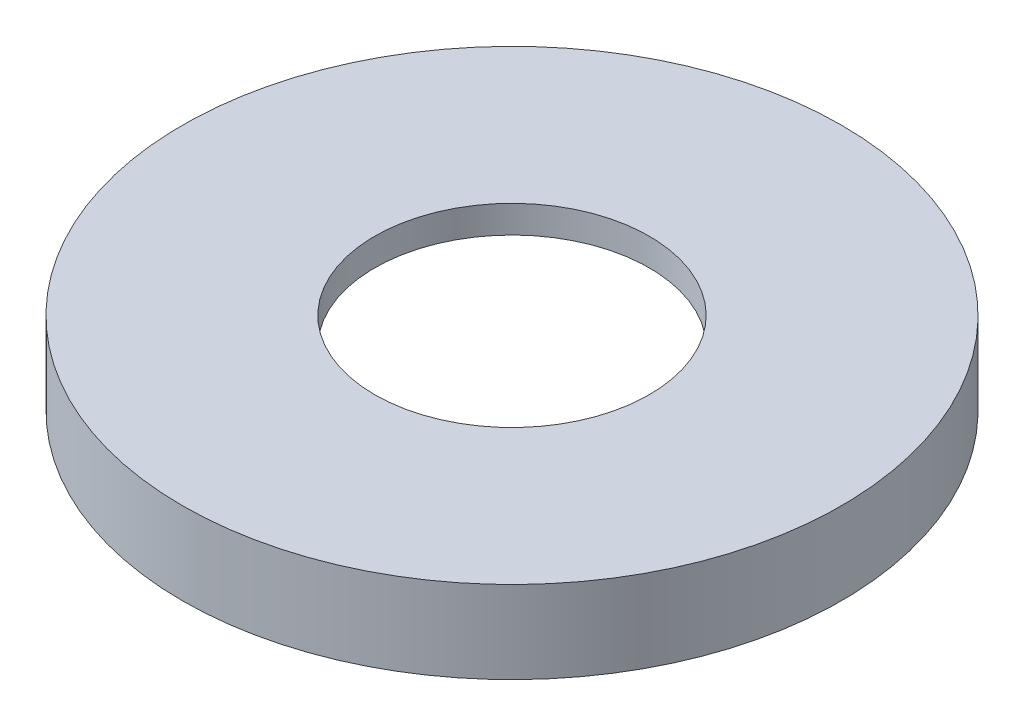
ISO-10303-21;
HEADER;
FILE_DESCRIPTION(('STEP AP214'),'2;1');
FILE_NAME('part.step','',(''),(''),'','','');
FILE_SCHEMA(('AUTOMOTIVE_DESIGN { 1 0 10303 214 1 1 1 1 }'));
ENDSEC;
DATA;
#1=APPLICATION_CONTEXT('core data for automotive mechanical design processes');
#2=APPLICATION_PROTOCOL_DEFINITION('international standard','automotive_design',2000,#1);
#3=PRODUCT_CONTEXT('',#1,'mechanical');
#4=PRODUCT('Part','Part','',(#3));
#5=PRODUCT_RELATED_PRODUCT_CATEGORY('part','',(#4));
#6=PRODUCT_DEFINITION_FORMATION('','',#4);
#7=PRODUCT_DEFINITION_CONTEXT('part definition',#1,'design');
#8=PRODUCT_DEFINITION('design','',#6,#7);
#9=PRODUCT_DEFINITION_SHAPE('','',#8);
#10=(LENGTH_UNIT() NAMED_UNIT(*) SI_UNIT(.MILLI.,.METRE.));
#11=(NAMED_UNIT(*) PLANE_ANGLE_UNIT() SI_UNIT($,.RADIAN.));
#12=(NAMED_UNIT(*) SI_UNIT($,.STERADIAN.) SOLID_ANGLE_UNIT());
#13=UNCERTAINTY_MEASURE_WITH_UNIT(LENGTH_MEASURE(1.E-05),#10,'distance_accuracy_value','');
#14=(GEOMETRIC_REPRESENTATION_CONTEXT(3) GLOBAL_UNCERTAINTY_ASSIGNED_CONTEXT((#13)) GLOBAL_UNIT_ASSIGNED_CONTEXT((#10,
#11,#12)) REPRESENTATION_CONTEXT('',''));
#15=CARTESIAN_POINT('',(0.,0.,0.));
#16=DIRECTION('',(0.,0.,1.));
#17=DIRECTION('',(1.,0.,0.));
#18=AXIS2_PLACEMENT_3D('',#15,#16,#17);
#19=CARTESIAN_POINT('',(0.,-6.35,0.));
#20=DIRECTION('',(0.,1.,0.));
#21=DIRECTION('',(0.,0.,1.));
#22=AXIS2_PLACEMENT_3D('',#19,#20,#21);
#23=CYLINDRICAL_SURFACE('',#22,38.1);
#24=CARTESIAN_POINT('',(0.,-6.35,0.));
#25=DIRECTION('',(0.,1.,0.));
#26=DIRECTION('',(0.,0.,1.));
#27=AXIS2_PLACEMENT_3D('',#24,#25,#26);
#28=CIRCLE('',#27,38.1);
#29=CARTESIAN_POINT('',(0.,-6.35,38.1));
#30=VERTEX_POINT('',#29);
#31=EDGE_CURVE('E10',#30,#30,#28,.T.);
#32=ORIENTED_EDGE('',*,*,#31,.T.);
#33=EDGE_LOOP('',(#32));
#34=FACE_BOUND('',#33,.T.);
#35=CARTESIAN_POINT('',(0.,3.175,0.));
#36=DIRECTION('',(0.,1.,0.));
#37=DIRECTION('',(0.,0.,1.));
#38=AXIS2_PLACEMENT_3D('',#35,#36,#37);
#39=CIRCLE('',#38,38.1);
#40=CARTESIAN_POINT('',(0.,3.175,38.1));
#41=VERTEX_POINT('',#40);
#42=EDGE_CURVE('E59',#41,#41,#39,.T.);
#43=ORIENTED_EDGE('',*,*,#42,.F.);
#44=EDGE_LOOP('',(#43));
#45=FACE_BOUND('',#44,.T.);
#46=ADVANCED_FACE('F41',(#34,#45),#23,.T.);
#47=CARTESIAN_POINT('',(0.,-6.35,0.));
#48=DIRECTION('',(0.,1.,0.));
#49=DIRECTION('',(0.,0.,1.));
#50=AXIS2_PLACEMENT_3D('',#47,#48,#49);
#51=PLANE('',#50);
#52=CARTESIAN_POINT('',(0.,-6.35,0.));
#53=DIRECTION('',(0.,1.,0.));
#54=DIRECTION('',(0.,0.,1.));
#55=AXIS2_PLACEMENT_3D('',#52,#53,#54);
#56=CIRCLE('',#55,33.0835);
#57=CARTESIAN_POINT('',(0.,-6.35,33.0835));
#58=VERTEX_POINT('',#57);
#59=EDGE_CURVE('E48',#58,#58,#56,.T.);
#60=ORIENTED_EDGE('',*,*,#59,.T.);
#61=EDGE_LOOP('',(#60));
#62=FACE_BOUND('',#61,.T.);
#63=ORIENTED_EDGE('',*,*,#31,.F.);
#64=EDGE_LOOP('',(#63));
#65=FACE_BOUND('',#64,.T.);
#66=ADVANCED_FACE('F90',(#62,#65),#51,.F.);
#67=CARTESIAN_POINT('',(0.,-6.35,0.));
#68=DIRECTION('',(0.,1.,0.));
#69=DIRECTION('',(0.,0.,1.));
#70=AXIS2_PLACEMENT_3D('',#67,#68,#69);
#71=CYLINDRICAL_SURFACE('',#70,33.0835);
#72=ORIENTED_EDGE('',*,*,#59,.F.);
#73=EDGE_LOOP('',(#72));
#74=FACE_BOUND('',#73,.T.);
#75=CARTESIAN_POINT('',(0.,0.,0.));
#76=DIRECTION('',(0.,1.,0.));
#77=DIRECTION('',(0.,0.,1.));
#78=AXIS2_PLACEMENT_3D('',#75,#76,#77);
#79=CIRCLE('',#78,33.0835);
#80=CARTESIAN_POINT('',(0.,0.,33.0835));
#81=VERTEX_POINT('',#80);
#82=EDGE_CURVE('E53',#81,#81,#79,.T.);
#83=ORIENTED_EDGE('',*,*,#82,.T.);
#84=EDGE_LOOP('',(#83));
#85=FACE_BOUND('',#84,.T.);
#86=ADVANCED_FACE('F86',(#74,#85),#71,.F.);
#87=CARTESIAN_POINT('',(0.,0.,0.));
#88=DIRECTION('',(0.,1.,0.));
#89=DIRECTION('',(0.,0.,1.));
#90=AXIS2_PLACEMENT_3D('',#87,#88,#89);
#91=PLANE('',#90);
#92=CARTESIAN_POINT('',(0.,0.,0.));
#93=DIRECTION('',(0.,1.,0.));
#94=DIRECTION('',(0.,0.,1.));
#95=AXIS2_PLACEMENT_3D('',#92,#93,#94);
#96=CIRCLE('',#95,15.875);
#97=CARTESIAN_POINT('',(0.,0.,15.875));
#98=VERTEX_POINT('',#97);
#99=EDGE_CURVE('E65',#98,#98,#96,.T.);
#100=ORIENTED_EDGE('',*,*,#99,.T.);
#101=EDGE_LOOP('',(#100));
#102=FACE_BOUND('',#101,.T.);
#103=ORIENTED_EDGE('',*,*,#82,.F.);
#104=EDGE_LOOP('',(#103));
#105=FACE_BOUND('',#104,.T.);
#106=ADVANCED_FACE('F78',(#102,#105),#91,.F.);
#107=CARTESIAN_POINT('',(0.,3.175,0.));
#108=DIRECTION('',(0.,1.,0.));
#109=DIRECTION('',(0.,0.,1.));
#110=AXIS2_PLACEMENT_3D('',#107,#108,#109);
#111=PLANE('',#110);
#112=ORIENTED_EDGE('',*,*,#42,.T.);
#113=EDGE_LOOP('',(#112));
#114=FACE_BOUND('',#113,.T.);
#115=CARTESIAN_POINT('',(0.,3.175,0.));
#116=DIRECTION('',(0.,1.,0.));
#117=DIRECTION('',(0.,0.,1.));
#118=AXIS2_PLACEMENT_3D('',#115,#116,#117);
#119=CIRCLE('',#118,15.875);
#120=CARTESIAN_POINT('',(0.,3.175,15.875));
#121=VERTEX_POINT('',#120);
#122=EDGE_CURVE('E64',#121,#121,#119,.T.);
#123=ORIENTED_EDGE('',*,*,#122,.F.);
#124=EDGE_LOOP('',(#123));
#125=FACE_BOUND('',#124,.T.);
#126=ADVANCED_FACE('F76',(#114,#125),#111,.T.);
#127=CARTESIAN_POINT('',(0.,3.175,0.));
#128=DIRECTION('',(0.,-1.,0.));
#129=DIRECTION('',(0.,0.,-1.));
#130=AXIS2_PLACEMENT_3D('',#127,#128,#129);
#131=CYLINDRICAL_SURFACE('',#130,15.875);
#132=ORIENTED_EDGE('',*,*,#122,.T.);
#133=EDGE_LOOP('',(#132));
#134=FACE_BOUND('',#133,.T.);
#135=ORIENTED_EDGE('',*,*,#99,.F.);
#136=EDGE_LOOP('',(#135));
#137=FACE_BOUND('',#136,.T.);
#138=ADVANCED_FACE('F73',(#134,#137),#131,.F.);
#139=CLOSED_SHELL('',(#46,#66,#86,#106,#126,#138));
#140=MANIFOLD_SOLID_BREP('B2',#139);
#141=ADVANCED_BREP_SHAPE_REPRESENTATION('',(#18,#140),#14);
#142=SHAPE_DEFINITION_REPRESENTATION(#9,#141);
ENDSEC;
END-ISO-10303-21;
